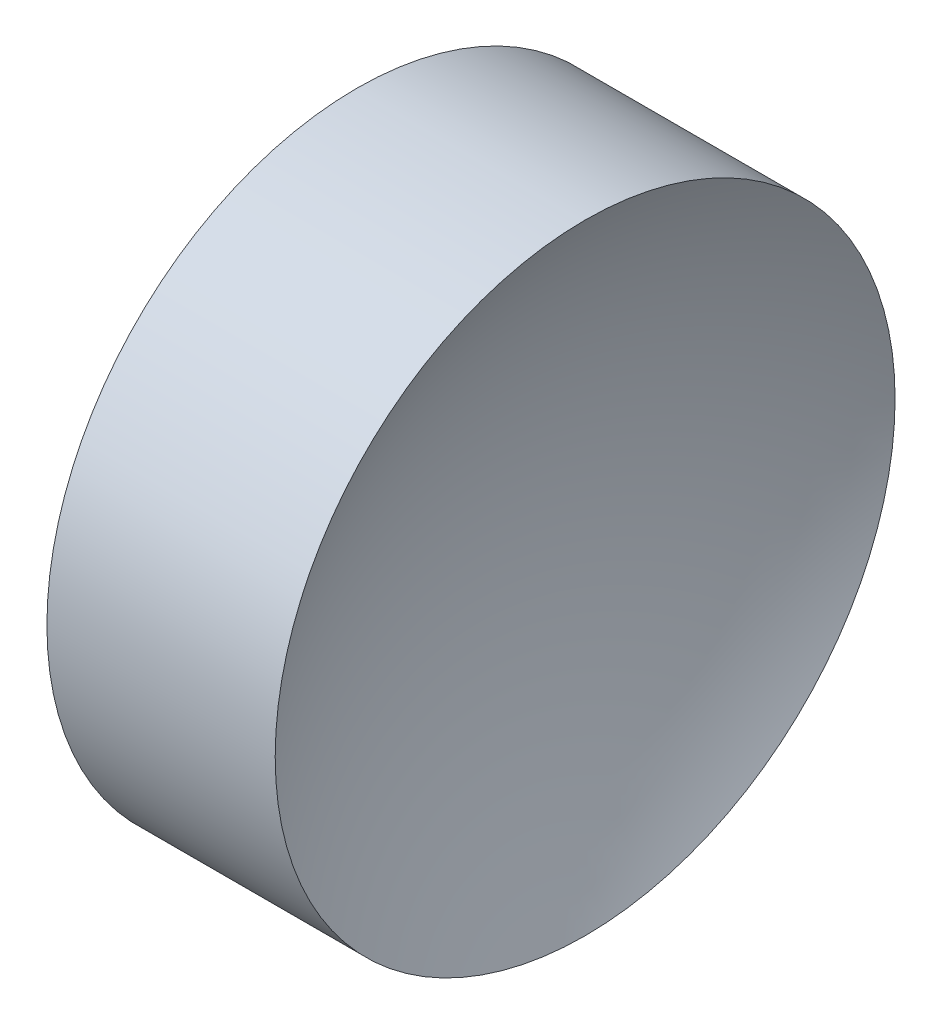
ISO-10303-21;
HEADER;
FILE_DESCRIPTION(('STEP AP214'),'2;1');
FILE_NAME('part.step','',(''),(''),'','','');
FILE_SCHEMA(('AUTOMOTIVE_DESIGN { 1 0 10303 214 1 1 1 1 }'));
ENDSEC;
DATA;
#1=APPLICATION_CONTEXT('core data for automotive mechanical design processes');
#2=APPLICATION_PROTOCOL_DEFINITION('international standard','automotive_design',2000,#1);
#3=PRODUCT_CONTEXT('',#1,'mechanical');
#4=PRODUCT('Part','Part','',(#3));
#5=PRODUCT_RELATED_PRODUCT_CATEGORY('part','',(#4));
#6=PRODUCT_DEFINITION_FORMATION('','',#4);
#7=PRODUCT_DEFINITION_CONTEXT('part definition',#1,'design');
#8=PRODUCT_DEFINITION('design','',#6,#7);
#9=PRODUCT_DEFINITION_SHAPE('','',#8);
#10=(LENGTH_UNIT() NAMED_UNIT(*) SI_UNIT(.MILLI.,.METRE.));
#11=(NAMED_UNIT(*) PLANE_ANGLE_UNIT() SI_UNIT($,.RADIAN.));
#12=(NAMED_UNIT(*) SI_UNIT($,.STERADIAN.) SOLID_ANGLE_UNIT());
#13=UNCERTAINTY_MEASURE_WITH_UNIT(LENGTH_MEASURE(1.E-05),#10,'distance_accuracy_value','');
#14=(GEOMETRIC_REPRESENTATION_CONTEXT(3) GLOBAL_UNCERTAINTY_ASSIGNED_CONTEXT((#13)) GLOBAL_UNIT_ASSIGNED_CONTEXT((#10,
#11,#12)) REPRESENTATION_CONTEXT('',''));
#15=CARTESIAN_POINT('',(0.,0.,0.));
#16=DIRECTION('',(0.,0.,1.));
#17=DIRECTION('',(1.,0.,0.));
#18=AXIS2_PLACEMENT_3D('',#15,#16,#17);
#19=CARTESIAN_POINT('',(30.2692688325745,13.031126091403,0.));
#20=DIRECTION('',(-1.,0.,0.));
#21=DIRECTION('',(0.,-1.,0.));
#22=AXIS2_PLACEMENT_3D('',#19,#20,#21);
#23=SPHERICAL_SURFACE('',#22,6.46);
#24=CARTESIAN_POINT('',(24.6293131589898,13.031126091403,0.));
#25=DIRECTION('',(-1.,0.,0.));
#26=DIRECTION('',(0.,0.,1.));
#27=AXIS2_PLACEMENT_3D('',#24,#25,#26);
#28=CIRCLE('',#27,3.15);
#29=CARTESIAN_POINT('',(24.6293131589898,13.031126091403,3.15));
#30=VERTEX_POINT('',#29);
#31=EDGE_CURVE('E10',#30,#30,#28,.T.);
#32=ORIENTED_EDGE('',*,*,#31,.F.);
#33=EDGE_LOOP('',(#32));
#34=FACE_BOUND('',#33,.T.);
#35=ADVANCED_FACE('F35',(#34),#23,.F.);
#36=CARTESIAN_POINT('',(20.6840306351329,13.031126091403,0.));
#37=DIRECTION('',(-1.,0.,0.));
#38=DIRECTION('',(0.,0.,1.));
#39=AXIS2_PLACEMENT_3D('',#36,#37,#38);
#40=CYLINDRICAL_SURFACE('',#39,3.15);
#41=CARTESIAN_POINT('',(22.3092688325745,13.031126091403,0.));
#42=DIRECTION('',(-1.,0.,0.));
#43=DIRECTION('',(0.,0.,1.));
#44=AXIS2_PLACEMENT_3D('',#41,#42,#43);
#45=CIRCLE('',#44,3.15);
#46=CARTESIAN_POINT('',(22.3092688325745,13.031126091403,3.15));
#47=VERTEX_POINT('',#46);
#48=EDGE_CURVE('E41',#47,#47,#45,.T.);
#49=ORIENTED_EDGE('',*,*,#48,.F.);
#50=EDGE_LOOP('',(#49));
#51=FACE_BOUND('',#50,.T.);
#52=ORIENTED_EDGE('',*,*,#31,.T.);
#53=EDGE_LOOP('',(#52));
#54=FACE_BOUND('',#53,.T.);
#55=ADVANCED_FACE('F49',(#51,#54),#40,.T.);
#56=CARTESIAN_POINT('',(22.3092688325745,13.031126091403,0.));
#57=DIRECTION('',(1.,0.,0.));
#58=DIRECTION('',(0.,0.,-1.));
#59=AXIS2_PLACEMENT_3D('',#56,#57,#58);
#60=PLANE('',#59);
#61=ORIENTED_EDGE('',*,*,#48,.T.);
#62=EDGE_LOOP('',(#61));
#63=FACE_BOUND('',#62,.T.);
#64=ADVANCED_FACE('F47',(#63),#60,.F.);
#65=CLOSED_SHELL('',(#35,#55,#64));
#66=MANIFOLD_SOLID_BREP('B2',#65);
#67=ADVANCED_BREP_SHAPE_REPRESENTATION('',(#18,#66),#14);
#68=SHAPE_DEFINITION_REPRESENTATION(#9,#67);
ENDSEC;
END-ISO-10303-21;
